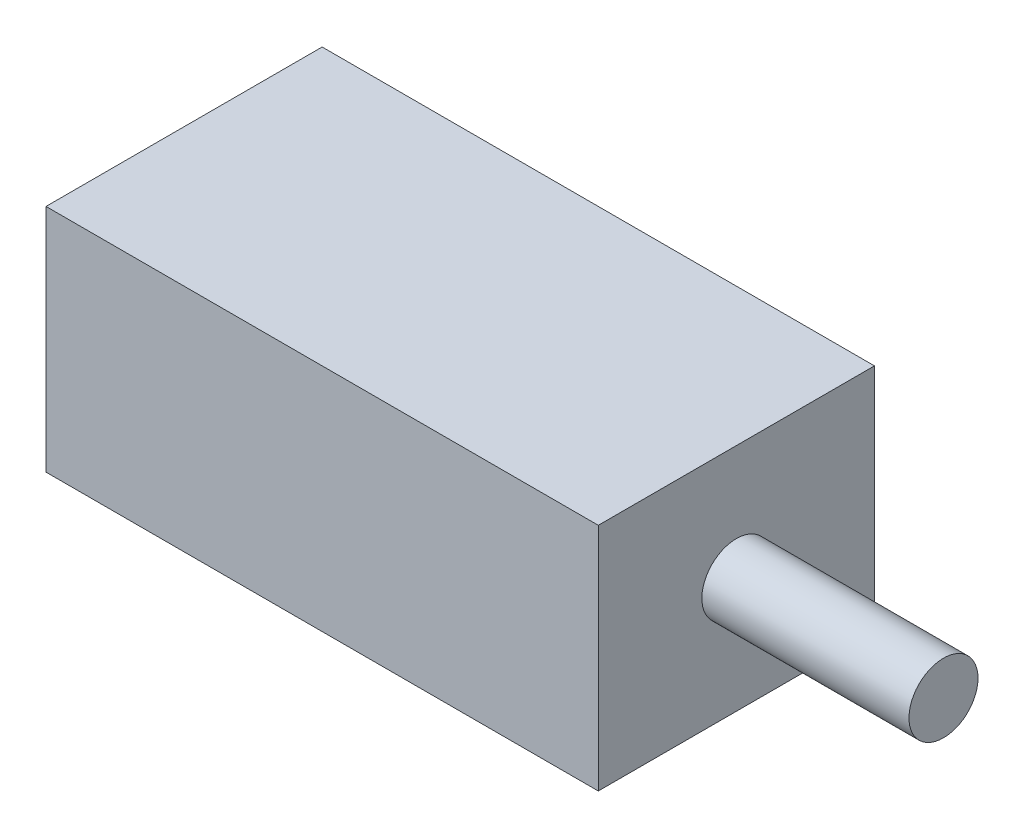
ISO-10303-21;
HEADER;
FILE_DESCRIPTION(('STEP AP214'),'2;1');
FILE_NAME('part.step','',(''),(''),'','','');
FILE_SCHEMA(('AUTOMOTIVE_DESIGN { 1 0 10303 214 1 1 1 1 }'));
ENDSEC;
DATA;
#1=APPLICATION_CONTEXT('core data for automotive mechanical design processes');
#2=APPLICATION_PROTOCOL_DEFINITION('international standard','automotive_design',2000,#1);
#3=PRODUCT_CONTEXT('',#1,'mechanical');
#4=PRODUCT('Part','Part','',(#3));
#5=PRODUCT_RELATED_PRODUCT_CATEGORY('part','',(#4));
#6=PRODUCT_DEFINITION_FORMATION('','',#4);
#7=PRODUCT_DEFINITION_CONTEXT('part definition',#1,'design');
#8=PRODUCT_DEFINITION('design','',#6,#7);
#9=PRODUCT_DEFINITION_SHAPE('','',#8);
#10=(LENGTH_UNIT() NAMED_UNIT(*) SI_UNIT(.MILLI.,.METRE.));
#11=(NAMED_UNIT(*) PLANE_ANGLE_UNIT() SI_UNIT($,.RADIAN.));
#12=(NAMED_UNIT(*) SI_UNIT($,.STERADIAN.) SOLID_ANGLE_UNIT());
#13=UNCERTAINTY_MEASURE_WITH_UNIT(LENGTH_MEASURE(1.E-05),#10,'distance_accuracy_value','');
#14=(GEOMETRIC_REPRESENTATION_CONTEXT(3) GLOBAL_UNCERTAINTY_ASSIGNED_CONTEXT((#13)) GLOBAL_UNIT_ASSIGNED_CONTEXT((#10,
#11,#12)) REPRESENTATION_CONTEXT('',''));
#15=CARTESIAN_POINT('',(0.,0.,0.));
#16=DIRECTION('',(0.,0.,1.));
#17=DIRECTION('',(1.,0.,0.));
#18=AXIS2_PLACEMENT_3D('',#15,#16,#17);
#19=CARTESIAN_POINT('',(12.,5.,6.));
#20=DIRECTION('',(-1.,0.,0.));
#21=DIRECTION('',(0.,-1.,0.));
#22=AXIS2_PLACEMENT_3D('',#19,#20,#21);
#23=PLANE('',#22);
#24=CARTESIAN_POINT('',(12.,0.,0.));
#25=DIRECTION('',(-1.,0.,0.));
#26=DIRECTION('',(0.,-1.,0.));
#27=AXIS2_PLACEMENT_3D('',#24,#25,#26);
#28=CIRCLE('',#27,1.5);
#29=CARTESIAN_POINT('',(12.,-1.5,0.));
#30=VERTEX_POINT('',#29);
#31=EDGE_CURVE('E11',#30,#30,#28,.F.);
#32=ORIENTED_EDGE('',*,*,#31,.F.);
#33=EDGE_LOOP('',(#32));
#34=FACE_BOUND('',#33,.T.);
#35=DIRECTION('',(0.,1.,0.));
#36=VECTOR('',#35,1.);
#37=CARTESIAN_POINT('',(12.,5.,-6.));
#38=LINE('',#37,#36);
#39=CARTESIAN_POINT('',(12.,-5.,-6.));
#40=VERTEX_POINT('',#39);
#41=CARTESIAN_POINT('',(12.,5.,-6.));
#42=VERTEX_POINT('',#41);
#43=EDGE_CURVE('E104',#40,#42,#38,.T.);
#44=ORIENTED_EDGE('',*,*,#43,.T.);
#45=DIRECTION('',(0.,0.,-1.));
#46=VECTOR('',#45,1.);
#47=CARTESIAN_POINT('',(12.,5.,6.));
#48=LINE('',#47,#46);
#49=CARTESIAN_POINT('',(12.,5.,6.));
#50=VERTEX_POINT('',#49);
#51=EDGE_CURVE('E46',#50,#42,#48,.T.);
#52=ORIENTED_EDGE('',*,*,#51,.F.);
#53=DIRECTION('',(0.,1.,0.));
#54=VECTOR('',#53,1.);
#55=CARTESIAN_POINT('',(12.,5.,6.));
#56=LINE('',#55,#54);
#57=CARTESIAN_POINT('',(12.,-5.,6.));
#58=VERTEX_POINT('',#57);
#59=EDGE_CURVE('E90',#58,#50,#56,.T.);
#60=ORIENTED_EDGE('',*,*,#59,.F.);
#61=DIRECTION('',(0.,0.,-1.));
#62=VECTOR('',#61,1.);
#63=CARTESIAN_POINT('',(12.,-5.,6.));
#64=LINE('',#63,#62);
#65=EDGE_CURVE('E100',#58,#40,#64,.T.);
#66=ORIENTED_EDGE('',*,*,#65,.T.);
#67=EDGE_LOOP('',(#44,#52,#60,#66));
#68=FACE_BOUND('',#67,.T.);
#69=ADVANCED_FACE('F38',(#34,#68),#23,.F.);
#70=CARTESIAN_POINT('',(-12.,5.,6.));
#71=DIRECTION('',(0.,-1.,0.));
#72=DIRECTION('',(0.,0.,-1.));
#73=AXIS2_PLACEMENT_3D('',#70,#71,#72);
#74=PLANE('',#73);
#75=DIRECTION('',(-1.,0.,0.));
#76=VECTOR('',#75,1.);
#77=CARTESIAN_POINT('',(-12.,5.,-6.));
#78=LINE('',#77,#76);
#79=CARTESIAN_POINT('',(-12.,5.,-6.));
#80=VERTEX_POINT('',#79);
#81=EDGE_CURVE('E95',#42,#80,#78,.T.);
#82=ORIENTED_EDGE('',*,*,#81,.T.);
#83=DIRECTION('',(0.,0.,-1.));
#84=VECTOR('',#83,1.);
#85=CARTESIAN_POINT('',(-12.,5.,6.));
#86=LINE('',#85,#84);
#87=CARTESIAN_POINT('',(-12.,5.,6.));
#88=VERTEX_POINT('',#87);
#89=EDGE_CURVE('E93',#88,#80,#86,.T.);
#90=ORIENTED_EDGE('',*,*,#89,.F.);
#91=DIRECTION('',(-1.,0.,0.));
#92=VECTOR('',#91,1.);
#93=CARTESIAN_POINT('',(-12.,5.,6.));
#94=LINE('',#93,#92);
#95=EDGE_CURVE('E85',#50,#88,#94,.T.);
#96=ORIENTED_EDGE('',*,*,#95,.F.);
#97=ORIENTED_EDGE('',*,*,#51,.T.);
#98=EDGE_LOOP('',(#82,#90,#96,#97));
#99=FACE_BOUND('',#98,.T.);
#100=ADVANCED_FACE('F94',(#99),#74,.F.);
#101=CARTESIAN_POINT('',(-12.,5.,6.));
#102=DIRECTION('',(1.,0.,0.));
#103=DIRECTION('',(0.,0.,-1.));
#104=AXIS2_PLACEMENT_3D('',#101,#102,#103);
#105=PLANE('',#104);
#106=DIRECTION('',(0.,-1.,0.));
#107=VECTOR('',#106,1.);
#108=CARTESIAN_POINT('',(-12.,5.,-6.));
#109=LINE('',#108,#107);
#110=CARTESIAN_POINT('',(-12.,-5.,-6.));
#111=VERTEX_POINT('',#110);
#112=EDGE_CURVE('E71',#80,#111,#109,.T.);
#113=ORIENTED_EDGE('',*,*,#112,.T.);
#114=DIRECTION('',(0.,0.,-1.));
#115=VECTOR('',#114,1.);
#116=CARTESIAN_POINT('',(-12.,-5.,6.));
#117=LINE('',#116,#115);
#118=CARTESIAN_POINT('',(-12.,-5.,6.));
#119=VERTEX_POINT('',#118);
#120=EDGE_CURVE('E96',#119,#111,#117,.T.);
#121=ORIENTED_EDGE('',*,*,#120,.F.);
#122=DIRECTION('',(0.,-1.,0.));
#123=VECTOR('',#122,1.);
#124=CARTESIAN_POINT('',(-12.,5.,6.));
#125=LINE('',#124,#123);
#126=EDGE_CURVE('E88',#88,#119,#125,.T.);
#127=ORIENTED_EDGE('',*,*,#126,.F.);
#128=ORIENTED_EDGE('',*,*,#89,.T.);
#129=EDGE_LOOP('',(#113,#121,#127,#128));
#130=FACE_BOUND('',#129,.T.);
#131=ADVANCED_FACE('F98',(#130),#105,.F.);
#132=CARTESIAN_POINT('',(-12.,-5.,6.));
#133=DIRECTION('',(0.,1.,0.));
#134=DIRECTION('',(0.,0.,1.));
#135=AXIS2_PLACEMENT_3D('',#132,#133,#134);
#136=PLANE('',#135);
#137=DIRECTION('',(1.,0.,0.));
#138=VECTOR('',#137,1.);
#139=CARTESIAN_POINT('',(-12.,-5.,-6.));
#140=LINE('',#139,#138);
#141=EDGE_CURVE('E77',#111,#40,#140,.T.);
#142=ORIENTED_EDGE('',*,*,#141,.T.);
#143=ORIENTED_EDGE('',*,*,#65,.F.);
#144=DIRECTION('',(1.,0.,0.));
#145=VECTOR('',#144,1.);
#146=CARTESIAN_POINT('',(-12.,-5.,6.));
#147=LINE('',#146,#145);
#148=EDGE_CURVE('E54',#119,#58,#147,.T.);
#149=ORIENTED_EDGE('',*,*,#148,.F.);
#150=ORIENTED_EDGE('',*,*,#120,.T.);
#151=EDGE_LOOP('',(#142,#143,#149,#150));
#152=FACE_BOUND('',#151,.T.);
#153=ADVANCED_FACE('F127',(#152),#136,.F.);
#154=CARTESIAN_POINT('',(0.,0.,6.));
#155=DIRECTION('',(0.,0.,1.));
#156=DIRECTION('',(1.,0.,0.));
#157=AXIS2_PLACEMENT_3D('',#154,#155,#156);
#158=PLANE('',#157);
#159=ORIENTED_EDGE('',*,*,#59,.T.);
#160=ORIENTED_EDGE('',*,*,#95,.T.);
#161=ORIENTED_EDGE('',*,*,#126,.T.);
#162=ORIENTED_EDGE('',*,*,#148,.T.);
#163=EDGE_LOOP('',(#159,#160,#161,#162));
#164=FACE_BOUND('',#163,.T.);
#165=ADVANCED_FACE('F86',(#164),#158,.T.);
#166=CARTESIAN_POINT('',(0.,0.,-6.));
#167=DIRECTION('',(0.,0.,1.));
#168=DIRECTION('',(1.,0.,0.));
#169=AXIS2_PLACEMENT_3D('',#166,#167,#168);
#170=PLANE('',#169);
#171=ORIENTED_EDGE('',*,*,#43,.F.);
#172=ORIENTED_EDGE('',*,*,#141,.F.);
#173=ORIENTED_EDGE('',*,*,#112,.F.);
#174=ORIENTED_EDGE('',*,*,#81,.F.);
#175=EDGE_LOOP('',(#171,#172,#173,#174));
#176=FACE_BOUND('',#175,.T.);
#177=ADVANCED_FACE('F115',(#176),#170,.F.);
#178=CARTESIAN_POINT('',(21.,0.,0.));
#179=DIRECTION('',(-1.,0.,0.));
#180=DIRECTION('',(0.,0.,1.));
#181=AXIS2_PLACEMENT_3D('',#178,#179,#180);
#182=CYLINDRICAL_SURFACE('',#181,1.5);
#183=CARTESIAN_POINT('',(21.,0.,0.));
#184=DIRECTION('',(1.,0.,0.));
#185=DIRECTION('',(0.,0.,-1.));
#186=AXIS2_PLACEMENT_3D('',#183,#184,#185);
#187=CIRCLE('',#186,1.5);
#188=CARTESIAN_POINT('',(21.,0.,-1.5));
#189=VERTEX_POINT('',#188);
#190=EDGE_CURVE('E107',#189,#189,#187,.T.);
#191=ORIENTED_EDGE('',*,*,#190,.F.);
#192=EDGE_LOOP('',(#191));
#193=FACE_BOUND('',#192,.T.);
#194=ORIENTED_EDGE('',*,*,#31,.T.);
#195=EDGE_LOOP('',(#194));
#196=FACE_BOUND('',#195,.T.);
#197=ADVANCED_FACE('F117',(#193,#196),#182,.T.);
#198=CARTESIAN_POINT('',(21.,0.,0.));
#199=DIRECTION('',(1.,0.,0.));
#200=DIRECTION('',(0.,0.,-1.));
#201=AXIS2_PLACEMENT_3D('',#198,#199,#200);
#202=PLANE('',#201);
#203=ORIENTED_EDGE('',*,*,#190,.T.);
#204=EDGE_LOOP('',(#203));
#205=FACE_BOUND('',#204,.T.);
#206=ADVANCED_FACE('F123',(#205),#202,.T.);
#207=CLOSED_SHELL('',(#69,#100,#131,#153,#165,#177,#197,#206));
#208=MANIFOLD_SOLID_BREP('B2',#207);
#209=ADVANCED_BREP_SHAPE_REPRESENTATION('',(#18,#208),#14);
#210=SHAPE_DEFINITION_REPRESENTATION(#9,#209);
ENDSEC;
END-ISO-10303-21;
